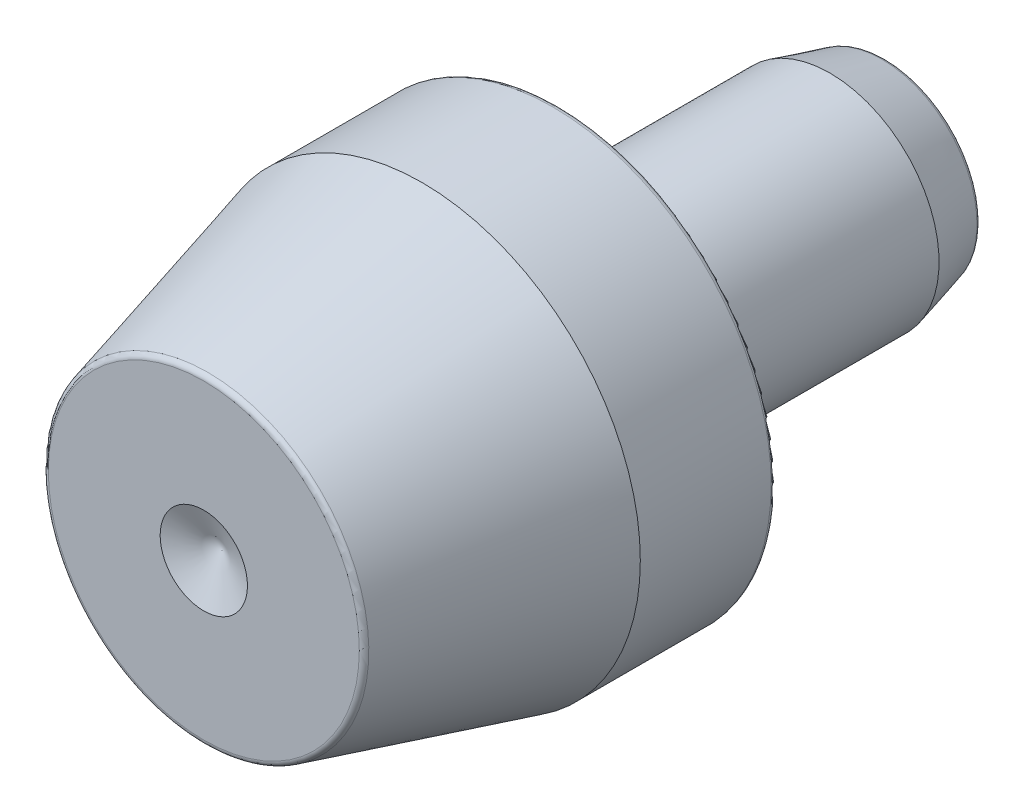
ISO-10303-21;
HEADER;
FILE_DESCRIPTION(('STEP AP214'),'2;1');
FILE_NAME('part.step','',(''),(''),'','','');
FILE_SCHEMA(('AUTOMOTIVE_DESIGN { 1 0 10303 214 1 1 1 1 }'));
ENDSEC;
DATA;
#1=APPLICATION_CONTEXT('core data for automotive mechanical design processes');
#2=APPLICATION_PROTOCOL_DEFINITION('international standard','automotive_design',2000,#1);
#3=PRODUCT_CONTEXT('',#1,'mechanical');
#4=PRODUCT('Part','Part','',(#3));
#5=PRODUCT_RELATED_PRODUCT_CATEGORY('part','',(#4));
#6=PRODUCT_DEFINITION_FORMATION('','',#4);
#7=PRODUCT_DEFINITION_CONTEXT('part definition',#1,'design');
#8=PRODUCT_DEFINITION('design','',#6,#7);
#9=PRODUCT_DEFINITION_SHAPE('','',#8);
#10=(LENGTH_UNIT() NAMED_UNIT(*) SI_UNIT(.MILLI.,.METRE.));
#11=(NAMED_UNIT(*) PLANE_ANGLE_UNIT() SI_UNIT($,.RADIAN.));
#12=(NAMED_UNIT(*) SI_UNIT($,.STERADIAN.) SOLID_ANGLE_UNIT());
#13=UNCERTAINTY_MEASURE_WITH_UNIT(LENGTH_MEASURE(1.E-05),#10,'distance_accuracy_value','');
#14=(GEOMETRIC_REPRESENTATION_CONTEXT(3) GLOBAL_UNCERTAINTY_ASSIGNED_CONTEXT((#13)) GLOBAL_UNIT_ASSIGNED_CONTEXT((#10,
#11,#12)) REPRESENTATION_CONTEXT('',''));
#15=CARTESIAN_POINT('',(0.,0.,0.));
#16=DIRECTION('',(0.,0.,1.));
#17=DIRECTION('',(1.,0.,0.));
#18=AXIS2_PLACEMENT_3D('',#15,#16,#17);
#19=CARTESIAN_POINT('',(0.,0.,12.5));
#20=DIRECTION('',(0.,0.,1.));
#21=DIRECTION('',(0.,-1.,0.));
#22=AXIS2_PLACEMENT_3D('',#19,#20,#21);
#23=CONICAL_SURFACE('',#22,1.6,1.17809724509618);
#24=CARTESIAN_POINT('',(0.,0.,11.8372583002031));
#25=VERTEX_POINT('',#24);
#26=VERTEX_LOOP('',#25);
#27=FACE_BOUND('',#26,.T.);
#28=CARTESIAN_POINT('',(0.,0.,12.5));
#29=DIRECTION('',(0.,0.,-1.));
#30=DIRECTION('',(0.,1.,0.));
#31=AXIS2_PLACEMENT_3D('',#28,#29,#30);
#32=CIRCLE('',#31,1.6);
#33=CARTESIAN_POINT('',(0.,1.6,12.5));
#34=VERTEX_POINT('',#33);
#35=EDGE_CURVE('E12',#34,#34,#32,.T.);
#36=ORIENTED_EDGE('',*,*,#35,.F.);
#37=EDGE_LOOP('',(#36));
#38=FACE_BOUND('',#37,.T.);
#39=ADVANCED_FACE('F184',(#27,#38),#23,.F.);
#40=CARTESIAN_POINT('',(0.,1.6,12.5));
#41=DIRECTION('',(0.,0.,1.));
#42=DIRECTION('',(0.,-1.,0.));
#43=AXIS2_PLACEMENT_3D('',#40,#41,#42);
#44=PLANE('',#43);
#45=ORIENTED_EDGE('',*,*,#35,.T.);
#46=EDGE_LOOP('',(#45));
#47=FACE_BOUND('',#46,.T.);
#48=CARTESIAN_POINT('',(0.,0.,12.5));
#49=DIRECTION('',(0.,0.,-1.));
#50=DIRECTION('',(0.,1.,0.));
#51=AXIS2_PLACEMENT_3D('',#48,#49,#50);
#52=CIRCLE('',#51,5.69910442801533);
#53=CARTESIAN_POINT('',(0.,5.69910442801533,12.5));
#54=VERTEX_POINT('',#53);
#55=EDGE_CURVE('E190',#54,#54,#52,.T.);
#56=ORIENTED_EDGE('',*,*,#55,.F.);
#57=EDGE_LOOP('',(#56));
#58=FACE_BOUND('',#57,.T.);
#59=ADVANCED_FACE('F195',(#47,#58),#44,.T.);
#60=CARTESIAN_POINT('',(0.,0.,12.295));
#61=DIRECTION('',(0.,0.,-1.));
#62=DIRECTION('',(0.,1.,0.));
#63=AXIS2_PLACEMENT_3D('',#60,#61,#62);
#64=TOROIDAL_SURFACE('',#63,5.69910442801533,0.205);
#65=ORIENTED_EDGE('',*,*,#55,.T.);
#66=EDGE_LOOP('',(#65));
#67=FACE_BOUND('',#66,.T.);
#68=CARTESIAN_POINT('',(0.,0.,12.348057904246));
#69=DIRECTION('',(0.,0.,-1.));
#70=DIRECTION('',(0.,1.,0.));
#71=AXIS2_PLACEMENT_3D('',#68,#69,#70);
#72=CIRCLE('',#71,5.89711922240459);
#73=CARTESIAN_POINT('',(0.,5.89711922240459,12.348057904246));
#74=VERTEX_POINT('',#73);
#75=EDGE_CURVE('E204',#74,#74,#72,.T.);
#76=ORIENTED_EDGE('',*,*,#75,.F.);
#77=EDGE_LOOP('',(#76));
#78=FACE_BOUND('',#77,.T.);
#79=ADVANCED_FACE('F200',(#67,#78),#64,.T.);
#80=CARTESIAN_POINT('',(0.,0.,4.5));
#81=DIRECTION('',(0.,0.,-1.));
#82=DIRECTION('',(0.,1.,0.));
#83=AXIS2_PLACEMENT_3D('',#80,#81,#82);
#84=CONICAL_SURFACE('',#83,8.,0.26179938779915);
#85=ORIENTED_EDGE('',*,*,#75,.T.);
#86=EDGE_LOOP('',(#85));
#87=FACE_BOUND('',#86,.T.);
#88=CARTESIAN_POINT('',(0.,0.,4.5));
#89=DIRECTION('',(0.,0.,-1.));
#90=DIRECTION('',(0.,1.,0.));
#91=AXIS2_PLACEMENT_3D('',#88,#89,#90);
#92=CIRCLE('',#91,8.);
#93=CARTESIAN_POINT('',(0.,8.,4.5));
#94=VERTEX_POINT('',#93);
#95=EDGE_CURVE('E206',#94,#94,#92,.T.);
#96=ORIENTED_EDGE('',*,*,#95,.F.);
#97=EDGE_LOOP('',(#96));
#98=FACE_BOUND('',#97,.T.);
#99=ADVANCED_FACE('F295',(#87,#98),#84,.T.);
#100=CARTESIAN_POINT('',(0.,0.,-12.5));
#101=DIRECTION('',(0.,0.,-1.));
#102=DIRECTION('',(0.,1.,0.));
#103=AXIS2_PLACEMENT_3D('',#100,#101,#102);
#104=CYLINDRICAL_SURFACE('',#103,8.);
#105=ORIENTED_EDGE('',*,*,#95,.T.);
#106=EDGE_LOOP('',(#105));
#107=FACE_BOUND('',#106,.T.);
#108=CARTESIAN_POINT('',(0.,0.,-0.294999999999998));
#109=DIRECTION('',(0.,0.,-1.));
#110=DIRECTION('',(0.,1.,0.));
#111=AXIS2_PLACEMENT_3D('',#108,#109,#110);
#112=CIRCLE('',#111,8.);
#113=CARTESIAN_POINT('',(0.,8.,-0.294999999999998));
#114=VERTEX_POINT('',#113);
#115=EDGE_CURVE('E211',#114,#114,#112,.T.);
#116=ORIENTED_EDGE('',*,*,#115,.F.);
#117=EDGE_LOOP('',(#116));
#118=FACE_BOUND('',#117,.T.);
#119=ADVANCED_FACE('F291',(#107,#118),#104,.T.);
#120=CARTESIAN_POINT('',(0.,0.,-0.294999999999998));
#121=DIRECTION('',(0.,0.,-1.));
#122=DIRECTION('',(0.,1.,0.));
#123=AXIS2_PLACEMENT_3D('',#120,#121,#122);
#124=TOROIDAL_SURFACE('',#123,7.795,0.204999999999999);
#125=ORIENTED_EDGE('',*,*,#115,.T.);
#126=EDGE_LOOP('',(#125));
#127=FACE_BOUND('',#126,.T.);
#128=CARTESIAN_POINT('',(0.,0.,-0.499999999999997));
#129=DIRECTION('',(0.,0.,-1.));
#130=DIRECTION('',(0.,1.,0.));
#131=AXIS2_PLACEMENT_3D('',#128,#129,#130);
#132=CIRCLE('',#131,7.795);
#133=CARTESIAN_POINT('',(0.,7.795,-0.499999999999996));
#134=VERTEX_POINT('',#133);
#135=EDGE_CURVE('E214',#134,#134,#132,.T.);
#136=ORIENTED_EDGE('',*,*,#135,.F.);
#137=EDGE_LOOP('',(#136));
#138=FACE_BOUND('',#137,.T.);
#139=ADVANCED_FACE('F287',(#127,#138),#124,.T.);
#140=CARTESIAN_POINT('',(0.,7.795,-0.499999999999998));
#141=DIRECTION('',(0.,0.,-1.));
#142=DIRECTION('',(0.,1.,0.));
#143=AXIS2_PLACEMENT_3D('',#140,#141,#142);
#144=PLANE('',#143);
#145=ORIENTED_EDGE('',*,*,#135,.T.);
#146=EDGE_LOOP('',(#145));
#147=FACE_BOUND('',#146,.T.);
#148=CARTESIAN_POINT('',(0.,0.,-0.499999999999999));
#149=DIRECTION('',(0.,0.,-1.));
#150=DIRECTION('',(0.,1.,0.));
#151=AXIS2_PLACEMENT_3D('',#148,#149,#150);
#152=CIRCLE('',#151,4.615);
#153=CARTESIAN_POINT('',(0.,4.615,-0.499999999999998));
#154=VERTEX_POINT('',#153);
#155=EDGE_CURVE('E217',#154,#154,#152,.T.);
#156=ORIENTED_EDGE('',*,*,#155,.F.);
#157=EDGE_LOOP('',(#156));
#158=FACE_BOUND('',#157,.T.);
#159=ADVANCED_FACE('F283',(#147,#158),#144,.T.);
#160=CARTESIAN_POINT('',(0.,0.,-0.499999999999998));
#161=DIRECTION('',(0.,0.,-1.));
#162=DIRECTION('',(0.,1.,0.));
#163=AXIS2_PLACEMENT_3D('',#160,#161,#162);
#164=TOROIDAL_SURFACE('',#163,4.41,0.204999999999999);
#165=ORIENTED_EDGE('',*,*,#155,.T.);
#166=EDGE_LOOP('',(#165));
#167=FACE_BOUND('',#166,.T.);
#168=CARTESIAN_POINT('',(0.,0.,-0.294999999999998));
#169=DIRECTION('',(0.,0.,-1.));
#170=DIRECTION('',(0.,1.,0.));
#171=AXIS2_PLACEMENT_3D('',#168,#169,#170);
#172=CIRCLE('',#171,4.41);
#173=CARTESIAN_POINT('',(0.,4.41,-0.294999999999998));
#174=VERTEX_POINT('',#173);
#175=EDGE_CURVE('E220',#174,#174,#172,.T.);
#176=ORIENTED_EDGE('',*,*,#175,.F.);
#177=EDGE_LOOP('',(#176));
#178=FACE_BOUND('',#177,.T.);
#179=ADVANCED_FACE('F279',(#167,#178),#164,.F.);
#180=CARTESIAN_POINT('',(0.,4.41,-0.294999999999998));
#181=DIRECTION('',(0.,0.,-1.));
#182=DIRECTION('',(0.,1.,0.));
#183=AXIS2_PLACEMENT_3D('',#180,#181,#182);
#184=PLANE('',#183);
#185=ORIENTED_EDGE('',*,*,#175,.T.);
#186=EDGE_LOOP('',(#185));
#187=FACE_BOUND('',#186,.T.);
#188=CARTESIAN_POINT('',(0.,0.,-0.294999999999998));
#189=DIRECTION('',(0.,0.,-1.));
#190=DIRECTION('',(0.,1.,0.));
#191=AXIS2_PLACEMENT_3D('',#188,#189,#190);
#192=CIRCLE('',#191,4.);
#193=CARTESIAN_POINT('',(0.,4.,-0.294999999999998));
#194=VERTEX_POINT('',#193);
#195=EDGE_CURVE('E223',#194,#194,#192,.T.);
#196=ORIENTED_EDGE('',*,*,#195,.F.);
#197=EDGE_LOOP('',(#196));
#198=FACE_BOUND('',#197,.T.);
#199=ADVANCED_FACE('F275',(#187,#198),#184,.T.);
#200=CARTESIAN_POINT('',(0.,0.,-0.499999999999998));
#201=DIRECTION('',(0.,0.,-1.));
#202=DIRECTION('',(0.,1.,0.));
#203=AXIS2_PLACEMENT_3D('',#200,#201,#202);
#204=TOROIDAL_SURFACE('',#203,4.,0.205);
#205=ORIENTED_EDGE('',*,*,#195,.T.);
#206=EDGE_LOOP('',(#205));
#207=FACE_BOUND('',#206,.T.);
#208=CARTESIAN_POINT('',(0.,0.,-0.499999999999999));
#209=DIRECTION('',(0.,0.,-1.));
#210=DIRECTION('',(0.,1.,0.));
#211=AXIS2_PLACEMENT_3D('',#208,#209,#210);
#212=CIRCLE('',#211,3.795);
#213=CARTESIAN_POINT('',(0.,3.795,-0.499999999999998));
#214=VERTEX_POINT('',#213);
#215=EDGE_CURVE('E226',#214,#214,#212,.T.);
#216=ORIENTED_EDGE('',*,*,#215,.F.);
#217=EDGE_LOOP('',(#216));
#218=FACE_BOUND('',#217,.T.);
#219=ADVANCED_FACE('F271',(#207,#218),#204,.F.);
#220=CARTESIAN_POINT('',(0.,0.,-12.5));
#221=DIRECTION('',(0.,0.,-1.));
#222=DIRECTION('',(0.,1.,0.));
#223=AXIS2_PLACEMENT_3D('',#220,#221,#222);
#224=CYLINDRICAL_SURFACE('',#223,3.795);
#225=ORIENTED_EDGE('',*,*,#215,.T.);
#226=EDGE_LOOP('',(#225));
#227=FACE_BOUND('',#226,.T.);
#228=CARTESIAN_POINT('',(0.,0.,-1.525));
#229=DIRECTION('',(0.,0.,-1.));
#230=DIRECTION('',(0.,1.,0.));
#231=AXIS2_PLACEMENT_3D('',#228,#229,#230);
#232=CIRCLE('',#231,3.795);
#233=CARTESIAN_POINT('',(0.,3.795,-1.525));
#234=VERTEX_POINT('',#233);
#235=EDGE_CURVE('E229',#234,#234,#232,.T.);
#236=ORIENTED_EDGE('',*,*,#235,.F.);
#237=EDGE_LOOP('',(#236));
#238=FACE_BOUND('',#237,.T.);
#239=ADVANCED_FACE('F267',(#227,#238),#224,.T.);
#240=CARTESIAN_POINT('',(0.,0.,-1.73));
#241=DIRECTION('',(0.,0.,-1.));
#242=DIRECTION('',(0.,1.,0.));
#243=AXIS2_PLACEMENT_3D('',#240,#241,#242);
#244=CONICAL_SURFACE('',#243,4.,0.78539816339745);
#245=ORIENTED_EDGE('',*,*,#235,.T.);
#246=EDGE_LOOP('',(#245));
#247=FACE_BOUND('',#246,.T.);
#248=CARTESIAN_POINT('',(0.,0.,-1.73));
#249=DIRECTION('',(0.,0.,-1.));
#250=DIRECTION('',(0.,1.,0.));
#251=AXIS2_PLACEMENT_3D('',#248,#249,#250);
#252=CIRCLE('',#251,4.);
#253=CARTESIAN_POINT('',(0.,4.,-1.73));
#254=VERTEX_POINT('',#253);
#255=EDGE_CURVE('E232',#254,#254,#252,.T.);
#256=ORIENTED_EDGE('',*,*,#255,.F.);
#257=EDGE_LOOP('',(#256));
#258=FACE_BOUND('',#257,.T.);
#259=ADVANCED_FACE('F263',(#247,#258),#244,.T.);
#260=CARTESIAN_POINT('',(0.,0.,-12.5));
#261=DIRECTION('',(0.,0.,-1.));
#262=DIRECTION('',(0.,1.,0.));
#263=AXIS2_PLACEMENT_3D('',#260,#261,#262);
#264=CYLINDRICAL_SURFACE('',#263,4.);
#265=ORIENTED_EDGE('',*,*,#255,.T.);
#266=EDGE_LOOP('',(#265));
#267=FACE_BOUND('',#266,.T.);
#268=CARTESIAN_POINT('',(0.,0.,-10.45));
#269=DIRECTION('',(0.,0.,-1.));
#270=DIRECTION('',(0.,1.,0.));
#271=AXIS2_PLACEMENT_3D('',#268,#269,#270);
#272=CIRCLE('',#271,4.);
#273=CARTESIAN_POINT('',(0.,4.,-10.45));
#274=VERTEX_POINT('',#273);
#275=EDGE_CURVE('E235',#274,#274,#272,.T.);
#276=ORIENTED_EDGE('',*,*,#275,.F.);
#277=EDGE_LOOP('',(#276));
#278=FACE_BOUND('',#277,.T.);
#279=ADVANCED_FACE('F257',(#267,#278),#264,.T.);
#280=CARTESIAN_POINT('',(0.,0.,-12.348057904246));
#281=DIRECTION('',(0.,0.,1.));
#282=DIRECTION('',(0.,-1.,0.));
#283=AXIS2_PLACEMENT_3D('',#280,#281,#282);
#284=CONICAL_SURFACE('',#283,3.49141691736977,0.26179938779915);
#285=ORIENTED_EDGE('',*,*,#275,.T.);
#286=EDGE_LOOP('',(#285));
#287=FACE_BOUND('',#286,.T.);
#288=CARTESIAN_POINT('',(0.,0.,-12.348057904246));
#289=DIRECTION('',(0.,0.,-1.));
#290=DIRECTION('',(0.,1.,0.));
#291=AXIS2_PLACEMENT_3D('',#288,#289,#290);
#292=CIRCLE('',#291,3.49141691736977);
#293=CARTESIAN_POINT('',(0.,3.49141691736977,-12.348057904246));
#294=VERTEX_POINT('',#293);
#295=EDGE_CURVE('E238',#294,#294,#292,.T.);
#296=ORIENTED_EDGE('',*,*,#295,.F.);
#297=EDGE_LOOP('',(#296));
#298=FACE_BOUND('',#297,.T.);
#299=ADVANCED_FACE('F249',(#287,#298),#284,.T.);
#300=CARTESIAN_POINT('',(0.,0.,-12.295));
#301=DIRECTION('',(0.,0.,-1.));
#302=DIRECTION('',(0.,1.,0.));
#303=AXIS2_PLACEMENT_3D('',#300,#301,#302);
#304=TOROIDAL_SURFACE('',#303,3.29340212298051,0.205);
#305=ORIENTED_EDGE('',*,*,#295,.T.);
#306=EDGE_LOOP('',(#305));
#307=FACE_BOUND('',#306,.T.);
#308=CARTESIAN_POINT('',(0.,0.,-12.5));
#309=DIRECTION('',(0.,0.,-1.));
#310=DIRECTION('',(0.,1.,0.));
#311=AXIS2_PLACEMENT_3D('',#308,#309,#310);
#312=CIRCLE('',#311,3.29340212298051);
#313=CARTESIAN_POINT('',(0.,3.29340212298051,-12.5));
#314=VERTEX_POINT('',#313);
#315=EDGE_CURVE('E241',#314,#314,#312,.T.);
#316=ORIENTED_EDGE('',*,*,#315,.F.);
#317=EDGE_LOOP('',(#316));
#318=FACE_BOUND('',#317,.T.);
#319=ADVANCED_FACE('F247',(#307,#318),#304,.T.);
#320=CARTESIAN_POINT('',(0.,3.29340212298051,-12.5));
#321=DIRECTION('',(0.,0.,-1.));
#322=DIRECTION('',(0.,1.,0.));
#323=AXIS2_PLACEMENT_3D('',#320,#321,#322);
#324=PLANE('',#323);
#325=ORIENTED_EDGE('',*,*,#315,.T.);
#326=EDGE_LOOP('',(#325));
#327=FACE_BOUND('',#326,.T.);
#328=ADVANCED_FACE('F245',(#327),#324,.T.);
#329=CLOSED_SHELL('',(#39,#59,#79,#99,#119,#139,#159,#179,#199,#219,#239,#259,#279,#299,#319,#328));
#330=MANIFOLD_SOLID_BREP('B2',#329);
#331=ADVANCED_BREP_SHAPE_REPRESENTATION('',(#18,#330),#14);
#332=SHAPE_DEFINITION_REPRESENTATION(#9,#331);
ENDSEC;
END-ISO-10303-21;
